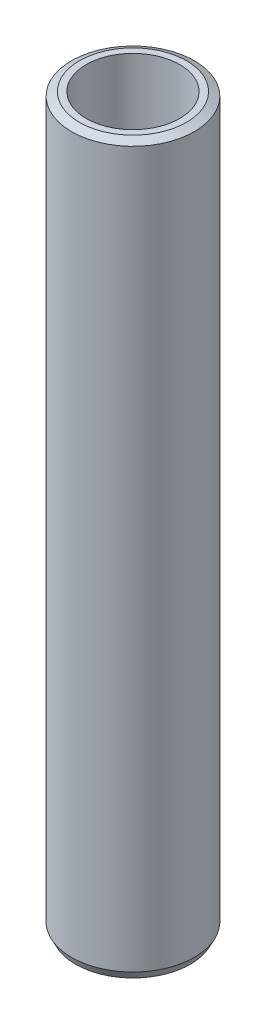
ISO-10303-21;
HEADER;
FILE_DESCRIPTION(('STEP AP214'),'2;1');
FILE_NAME('part.step','',(''),(''),'','','');
FILE_SCHEMA(('AUTOMOTIVE_DESIGN { 1 0 10303 214 1 1 1 1 }'));
ENDSEC;
DATA;
#1=APPLICATION_CONTEXT('core data for automotive mechanical design processes');
#2=APPLICATION_PROTOCOL_DEFINITION('international standard','automotive_design',2000,#1);
#3=PRODUCT_CONTEXT('',#1,'mechanical');
#4=PRODUCT('Part','Part','',(#3));
#5=PRODUCT_RELATED_PRODUCT_CATEGORY('part','',(#4));
#6=PRODUCT_DEFINITION_FORMATION('','',#4);
#7=PRODUCT_DEFINITION_CONTEXT('part definition',#1,'design');
#8=PRODUCT_DEFINITION('design','',#6,#7);
#9=PRODUCT_DEFINITION_SHAPE('','',#8);
#10=(LENGTH_UNIT() NAMED_UNIT(*) SI_UNIT(.MILLI.,.METRE.));
#11=(NAMED_UNIT(*) PLANE_ANGLE_UNIT() SI_UNIT($,.RADIAN.));
#12=(NAMED_UNIT(*) SI_UNIT($,.STERADIAN.) SOLID_ANGLE_UNIT());
#13=UNCERTAINTY_MEASURE_WITH_UNIT(LENGTH_MEASURE(1.E-05),#10,'distance_accuracy_value','');
#14=(GEOMETRIC_REPRESENTATION_CONTEXT(3) GLOBAL_UNCERTAINTY_ASSIGNED_CONTEXT((#13)) GLOBAL_UNIT_ASSIGNED_CONTEXT((#10,
#11,#12)) REPRESENTATION_CONTEXT('',''));
#15=CARTESIAN_POINT('',(0.,0.,0.));
#16=DIRECTION('',(0.,0.,1.));
#17=DIRECTION('',(1.,0.,0.));
#18=AXIS2_PLACEMENT_3D('',#15,#16,#17);
#19=CARTESIAN_POINT('',(0.,591.694880101326,0.));
#20=DIRECTION('',(0.,-1.,0.));
#21=DIRECTION('',(0.,0.,-1.));
#22=AXIS2_PLACEMENT_3D('',#19,#20,#21);
#23=CYLINDRICAL_SURFACE('',#22,50.);
#24=CARTESIAN_POINT('',(0.,588.426911412245,0.));
#25=DIRECTION('',(0.,1.,0.));
#26=DIRECTION('',(0.,0.,1.));
#27=AXIS2_PLACEMENT_3D('',#24,#25,#26);
#28=CIRCLE('',#27,50.);
#29=CARTESIAN_POINT('',(0.,588.426911412245,50.));
#30=VERTEX_POINT('',#29);
#31=EDGE_CURVE('E50',#30,#30,#28,.F.);
#32=ORIENTED_EDGE('',*,*,#31,.T.);
#33=EDGE_LOOP('',(#32));
#34=FACE_BOUND('',#33,.T.);
#35=CARTESIAN_POINT('',(0.,6.48914250771782,0.));
#36=DIRECTION('',(0.,1.,0.));
#37=DIRECTION('',(0.,0.,1.));
#38=AXIS2_PLACEMENT_3D('',#35,#36,#37);
#39=CIRCLE('',#38,50.);
#40=CARTESIAN_POINT('',(0.,6.48914250771782,50.));
#41=VERTEX_POINT('',#40);
#42=EDGE_CURVE('E51',#41,#41,#39,.T.);
#43=ORIENTED_EDGE('',*,*,#42,.T.);
#44=EDGE_LOOP('',(#43));
#45=FACE_BOUND('',#44,.T.);
#46=ADVANCED_FACE('F39',(#34,#45),#23,.T.);
#47=CARTESIAN_POINT('',(0.,591.694880101326,0.));
#48=DIRECTION('',(0.,1.,0.));
#49=DIRECTION('',(0.,0.,1.));
#50=AXIS2_PLACEMENT_3D('',#47,#48,#49);
#51=PLANE('',#50);
#52=CARTESIAN_POINT('',(0.,591.694880101326,0.));
#53=DIRECTION('',(0.,1.,0.));
#54=DIRECTION('',(0.,0.,1.));
#55=AXIS2_PLACEMENT_3D('',#52,#53,#54);
#56=CIRCLE('',#55,43.5108574922825);
#57=CARTESIAN_POINT('',(0.,591.694880101326,43.5108574922825));
#58=VERTEX_POINT('',#57);
#59=EDGE_CURVE('E54',#58,#58,#56,.T.);
#60=ORIENTED_EDGE('',*,*,#59,.T.);
#61=EDGE_LOOP('',(#60));
#62=FACE_BOUND('',#61,.T.);
#63=CARTESIAN_POINT('',(0.,591.694880101326,0.));
#64=DIRECTION('',(0.,1.,0.));
#65=DIRECTION('',(0.,0.,1.));
#66=AXIS2_PLACEMENT_3D('',#63,#64,#65);
#67=CIRCLE('',#66,38.0546855750366);
#68=CARTESIAN_POINT('',(0.,591.694880101326,38.0546855750366));
#69=VERTEX_POINT('',#68);
#70=EDGE_CURVE('E58',#69,#69,#67,.T.);
#71=ORIENTED_EDGE('',*,*,#70,.F.);
#72=EDGE_LOOP('',(#71));
#73=FACE_BOUND('',#72,.T.);
#74=ADVANCED_FACE('F69',(#62,#73),#51,.T.);
#75=CARTESIAN_POINT('',(0.,0.,0.));
#76=DIRECTION('',(0.,1.,0.));
#77=DIRECTION('',(0.,0.,1.));
#78=AXIS2_PLACEMENT_3D('',#75,#76,#77);
#79=PLANE('',#78);
#80=CARTESIAN_POINT('',(0.,0.,0.));
#81=DIRECTION('',(0.,1.,0.));
#82=DIRECTION('',(0.,0.,1.));
#83=AXIS2_PLACEMENT_3D('',#80,#81,#82);
#84=CIRCLE('',#83,46.7320313109187);
#85=CARTESIAN_POINT('',(0.,0.,46.7320313109187));
#86=VERTEX_POINT('',#85);
#87=EDGE_CURVE('E10',#86,#86,#84,.F.);
#88=ORIENTED_EDGE('',*,*,#87,.T.);
#89=EDGE_LOOP('',(#88));
#90=FACE_BOUND('',#89,.T.);
#91=CARTESIAN_POINT('',(0.,0.,0.));
#92=DIRECTION('',(0.,1.,0.));
#93=DIRECTION('',(0.,0.,1.));
#94=AXIS2_PLACEMENT_3D('',#91,#92,#93);
#95=CIRCLE('',#94,38.0546855750366);
#96=CARTESIAN_POINT('',(0.,0.,38.0546855750366));
#97=VERTEX_POINT('',#96);
#98=EDGE_CURVE('E63',#97,#97,#95,.T.);
#99=ORIENTED_EDGE('',*,*,#98,.T.);
#100=EDGE_LOOP('',(#99));
#101=FACE_BOUND('',#100,.T.);
#102=ADVANCED_FACE('F75',(#90,#101),#79,.F.);
#103=CARTESIAN_POINT('',(0.,591.694880101326,0.));
#104=DIRECTION('',(0.,-1.,0.));
#105=DIRECTION('',(0.,0.,-1.));
#106=AXIS2_PLACEMENT_3D('',#103,#104,#105);
#107=CYLINDRICAL_SURFACE('',#106,38.0546855750366);
#108=ORIENTED_EDGE('',*,*,#70,.T.);
#109=EDGE_LOOP('',(#108));
#110=FACE_BOUND('',#109,.T.);
#111=ORIENTED_EDGE('',*,*,#98,.F.);
#112=EDGE_LOOP('',(#111));
#113=FACE_BOUND('',#112,.T.);
#114=ADVANCED_FACE('F70',(#110,#113),#107,.F.);
#115=CARTESIAN_POINT('',(0.,591.694880101326,0.));
#116=DIRECTION('',(0.,-1.,0.));
#117=DIRECTION('',(0.,0.,-1.));
#118=AXIS2_PLACEMENT_3D('',#115,#116,#117);
#119=CONICAL_SURFACE('',#118,43.5108574922825,1.10426837738535);
#120=ORIENTED_EDGE('',*,*,#31,.F.);
#121=EDGE_LOOP('',(#120));
#122=FACE_BOUND('',#121,.T.);
#123=ORIENTED_EDGE('',*,*,#59,.F.);
#124=EDGE_LOOP('',(#123));
#125=FACE_BOUND('',#124,.T.);
#126=ADVANCED_FACE('F81',(#122,#125),#119,.T.);
#127=CARTESIAN_POINT('',(0.,6.48914250771782,0.));
#128=DIRECTION('',(0.,1.,0.));
#129=DIRECTION('',(0.,0.,1.));
#130=AXIS2_PLACEMENT_3D('',#127,#128,#129);
#131=CONICAL_SURFACE('',#130,50.,0.466527949409536);
#132=ORIENTED_EDGE('',*,*,#87,.F.);
#133=EDGE_LOOP('',(#132));
#134=FACE_BOUND('',#133,.T.);
#135=ORIENTED_EDGE('',*,*,#42,.F.);
#136=EDGE_LOOP('',(#135));
#137=FACE_BOUND('',#136,.T.);
#138=ADVANCED_FACE('F45',(#134,#137),#131,.T.);
#139=CLOSED_SHELL('',(#46,#74,#102,#114,#126,#138));
#140=MANIFOLD_SOLID_BREP('B2',#139);
#141=ADVANCED_BREP_SHAPE_REPRESENTATION('',(#18,#140),#14);
#142=SHAPE_DEFINITION_REPRESENTATION(#9,#141);
ENDSEC;
END-ISO-10303-21;
